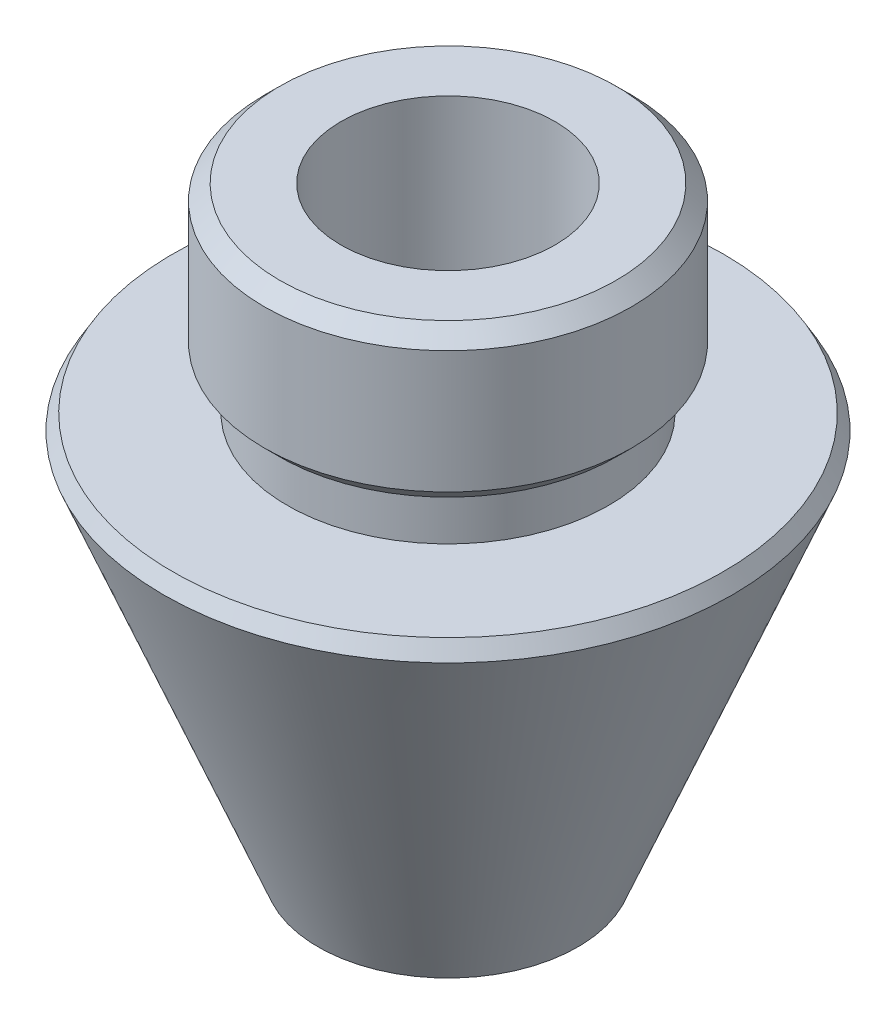
ISO-10303-21;
HEADER;
FILE_DESCRIPTION(('STEP AP214'),'2;1');
FILE_NAME('part.step','',(''),(''),'','','');
FILE_SCHEMA(('AUTOMOTIVE_DESIGN { 1 0 10303 214 1 1 1 1 }'));
ENDSEC;
DATA;
#1=APPLICATION_CONTEXT('core data for automotive mechanical design processes');
#2=APPLICATION_PROTOCOL_DEFINITION('international standard','automotive_design',2000,#1);
#3=PRODUCT_CONTEXT('',#1,'mechanical');
#4=PRODUCT('Part','Part','',(#3));
#5=PRODUCT_RELATED_PRODUCT_CATEGORY('part','',(#4));
#6=PRODUCT_DEFINITION_FORMATION('','',#4);
#7=PRODUCT_DEFINITION_CONTEXT('part definition',#1,'design');
#8=PRODUCT_DEFINITION('design','',#6,#7);
#9=PRODUCT_DEFINITION_SHAPE('','',#8);
#10=(LENGTH_UNIT() NAMED_UNIT(*) SI_UNIT(.MILLI.,.METRE.));
#11=(NAMED_UNIT(*) PLANE_ANGLE_UNIT() SI_UNIT($,.RADIAN.));
#12=(NAMED_UNIT(*) SI_UNIT($,.STERADIAN.) SOLID_ANGLE_UNIT());
#13=UNCERTAINTY_MEASURE_WITH_UNIT(LENGTH_MEASURE(1.E-05),#10,'distance_accuracy_value','');
#14=(GEOMETRIC_REPRESENTATION_CONTEXT(3) GLOBAL_UNCERTAINTY_ASSIGNED_CONTEXT((#13)) GLOBAL_UNIT_ASSIGNED_CONTEXT((#10,
#11,#12)) REPRESENTATION_CONTEXT('',''));
#15=CARTESIAN_POINT('',(0.,0.,0.));
#16=DIRECTION('',(0.,0.,1.));
#17=DIRECTION('',(1.,0.,0.));
#18=AXIS2_PLACEMENT_3D('',#15,#16,#17);
#19=CARTESIAN_POINT('',(0.,18.7681019127767,0.));
#20=DIRECTION('',(0.,-1.,0.));
#21=DIRECTION('',(0.,0.,-1.));
#22=AXIS2_PLACEMENT_3D('',#19,#20,#21);
#23=CONICAL_SURFACE('',#22,18.,0.5235987755983);
#24=CARTESIAN_POINT('',(0.,17.7491249910044,0.));
#25=DIRECTION('',(0.,-1.,0.));
#26=DIRECTION('',(0.,0.,-1.));
#27=AXIS2_PLACEMENT_3D('',#24,#25,#26);
#28=CIRCLE('',#27,18.5883066000832);
#29=CARTESIAN_POINT('',(0.,17.7491249910044,-18.5883066000832));
#30=VERTEX_POINT('',#29);
#31=EDGE_CURVE('E72',#30,#30,#28,.T.);
#32=ORIENTED_EDGE('',*,*,#31,.F.);
#33=EDGE_LOOP('',(#32));
#34=FACE_BOUND('',#33,.T.);
#35=CARTESIAN_POINT('',(0.,18.7681019127767,0.));
#36=DIRECTION('',(0.,-1.,0.));
#37=DIRECTION('',(0.,0.,-1.));
#38=AXIS2_PLACEMENT_3D('',#35,#36,#37);
#39=CIRCLE('',#38,18.);
#40=CARTESIAN_POINT('',(0.,18.7681019127767,-18.));
#41=VERTEX_POINT('',#40);
#42=EDGE_CURVE('E54',#41,#41,#39,.T.);
#43=ORIENTED_EDGE('',*,*,#42,.T.);
#44=EDGE_LOOP('',(#43));
#45=FACE_BOUND('',#44,.T.);
#46=ADVANCED_FACE('F34',(#34,#45),#23,.T.);
#47=CARTESIAN_POINT('',(0.,18.7681019127767,0.));
#48=DIRECTION('',(0.,-1.,0.));
#49=DIRECTION('',(0.,0.,-1.));
#50=AXIS2_PLACEMENT_3D('',#47,#48,#49);
#51=PLANE('',#50);
#52=ORIENTED_EDGE('',*,*,#42,.F.);
#53=EDGE_LOOP('',(#52));
#54=FACE_BOUND('',#53,.T.);
#55=CARTESIAN_POINT('',(0.,18.7681019127767,0.));
#56=DIRECTION('',(0.,-1.,0.));
#57=DIRECTION('',(0.,0.,-1.));
#58=AXIS2_PLACEMENT_3D('',#55,#56,#57);
#59=CIRCLE('',#58,10.5);
#60=CARTESIAN_POINT('',(0.,18.7681019127767,-10.5));
#61=VERTEX_POINT('',#60);
#62=EDGE_CURVE('E57',#61,#61,#59,.T.);
#63=ORIENTED_EDGE('',*,*,#62,.T.);
#64=EDGE_LOOP('',(#63));
#65=FACE_BOUND('',#64,.T.);
#66=ADVANCED_FACE('F80',(#54,#65),#51,.F.);
#67=CARTESIAN_POINT('',(0.,0.,0.));
#68=DIRECTION('',(0.,-1.,0.));
#69=DIRECTION('',(0.,0.,-1.));
#70=AXIS2_PLACEMENT_3D('',#67,#68,#69);
#71=CYLINDRICAL_SURFACE('',#70,10.5);
#72=CARTESIAN_POINT('',(0.,21.7681019127767,0.));
#73=DIRECTION('',(0.,-1.,0.));
#74=DIRECTION('',(0.,0.,-1.));
#75=AXIS2_PLACEMENT_3D('',#72,#73,#74);
#76=CIRCLE('',#75,10.5);
#77=CARTESIAN_POINT('',(0.,21.7681019127767,-10.5));
#78=VERTEX_POINT('',#77);
#79=EDGE_CURVE('E60',#78,#78,#76,.T.);
#80=ORIENTED_EDGE('',*,*,#79,.T.);
#81=EDGE_LOOP('',(#80));
#82=FACE_BOUND('',#81,.T.);
#83=ORIENTED_EDGE('',*,*,#62,.F.);
#84=EDGE_LOOP('',(#83));
#85=FACE_BOUND('',#84,.T.);
#86=ADVANCED_FACE('F86',(#82,#85),#71,.T.);
#87=CARTESIAN_POINT('',(0.,21.7681019127767,0.));
#88=DIRECTION('',(0.,-1.,0.));
#89=DIRECTION('',(0.,0.,-1.));
#90=AXIS2_PLACEMENT_3D('',#87,#88,#89);
#91=PLANE('',#90);
#92=CARTESIAN_POINT('',(0.,21.7681019127767,0.));
#93=DIRECTION('',(0.,-1.,0.));
#94=DIRECTION('',(0.,0.,-1.));
#95=AXIS2_PLACEMENT_3D('',#92,#93,#94);
#96=CIRCLE('',#95,11.);
#97=CARTESIAN_POINT('',(0.,21.7681019127767,-11.));
#98=VERTEX_POINT('',#97);
#99=EDGE_CURVE('E41',#98,#98,#96,.T.);
#100=ORIENTED_EDGE('',*,*,#99,.T.);
#101=EDGE_LOOP('',(#100));
#102=FACE_BOUND('',#101,.T.);
#103=ORIENTED_EDGE('',*,*,#79,.F.);
#104=EDGE_LOOP('',(#103));
#105=FACE_BOUND('',#104,.T.);
#106=ADVANCED_FACE('F91',(#102,#105),#91,.T.);
#107=CARTESIAN_POINT('',(0.,0.,0.));
#108=DIRECTION('',(0.,-1.,0.));
#109=DIRECTION('',(0.,0.,-1.));
#110=AXIS2_PLACEMENT_3D('',#107,#108,#109);
#111=CYLINDRICAL_SURFACE('',#110,12.);
#112=CARTESIAN_POINT('',(0.,22.7681019127766,0.));
#113=DIRECTION('',(0.,-1.,0.));
#114=DIRECTION('',(0.,0.,-1.));
#115=AXIS2_PLACEMENT_3D('',#112,#113,#114);
#116=CIRCLE('',#115,12.);
#117=CARTESIAN_POINT('',(0.,22.7681019127766,-12.));
#118=VERTEX_POINT('',#117);
#119=EDGE_CURVE('E10',#118,#118,#116,.F.);
#120=ORIENTED_EDGE('',*,*,#119,.T.);
#121=EDGE_LOOP('',(#120));
#122=FACE_BOUND('',#121,.T.);
#123=CARTESIAN_POINT('',(0.,30.7681019127767,0.));
#124=DIRECTION('',(0.,1.,0.));
#125=DIRECTION('',(0.,0.,1.));
#126=AXIS2_PLACEMENT_3D('',#123,#124,#125);
#127=CIRCLE('',#126,12.);
#128=CARTESIAN_POINT('',(0.,30.7681019127767,12.));
#129=VERTEX_POINT('',#128);
#130=EDGE_CURVE('E49',#129,#129,#127,.F.);
#131=ORIENTED_EDGE('',*,*,#130,.T.);
#132=EDGE_LOOP('',(#131));
#133=FACE_BOUND('',#132,.T.);
#134=ADVANCED_FACE('F97',(#122,#133),#111,.T.);
#135=CARTESIAN_POINT('',(0.,31.7681019127767,0.));
#136=DIRECTION('',(0.,1.,0.));
#137=DIRECTION('',(0.,0.,1.));
#138=AXIS2_PLACEMENT_3D('',#135,#136,#137);
#139=PLANE('',#138);
#140=CARTESIAN_POINT('',(0.,31.7681019127767,0.));
#141=DIRECTION('',(0.,1.,0.));
#142=DIRECTION('',(0.,0.,1.));
#143=AXIS2_PLACEMENT_3D('',#140,#141,#142);
#144=CIRCLE('',#143,11.);
#145=CARTESIAN_POINT('',(0.,31.7681019127767,11.));
#146=VERTEX_POINT('',#145);
#147=EDGE_CURVE('E45',#146,#146,#144,.T.);
#148=ORIENTED_EDGE('',*,*,#147,.T.);
#149=EDGE_LOOP('',(#148));
#150=FACE_BOUND('',#149,.T.);
#151=CARTESIAN_POINT('',(0.,31.7681019127767,0.));
#152=DIRECTION('',(0.,-1.,0.));
#153=DIRECTION('',(0.,0.,-1.));
#154=AXIS2_PLACEMENT_3D('',#151,#152,#153);
#155=CIRCLE('',#154,7.);
#156=CARTESIAN_POINT('',(0.,31.7681019127767,-7.));
#157=VERTEX_POINT('',#156);
#158=EDGE_CURVE('E63',#157,#157,#155,.T.);
#159=ORIENTED_EDGE('',*,*,#158,.T.);
#160=EDGE_LOOP('',(#159));
#161=FACE_BOUND('',#160,.T.);
#162=ADVANCED_FACE('F116',(#150,#161),#139,.T.);
#163=CARTESIAN_POINT('',(0.,0.,0.));
#164=DIRECTION('',(0.,-1.,0.));
#165=DIRECTION('',(0.,0.,-1.));
#166=AXIS2_PLACEMENT_3D('',#163,#164,#165);
#167=CYLINDRICAL_SURFACE('',#166,7.);
#168=CARTESIAN_POINT('',(0.,-7.23189808722334,0.));
#169=DIRECTION('',(0.,-1.,0.));
#170=DIRECTION('',(0.,0.,-1.));
#171=AXIS2_PLACEMENT_3D('',#168,#169,#170);
#172=CIRCLE('',#171,7.);
#173=CARTESIAN_POINT('',(0.,-7.23189808722334,-7.));
#174=VERTEX_POINT('',#173);
#175=EDGE_CURVE('E66',#174,#174,#172,.T.);
#176=ORIENTED_EDGE('',*,*,#175,.T.);
#177=EDGE_LOOP('',(#176));
#178=FACE_BOUND('',#177,.T.);
#179=ORIENTED_EDGE('',*,*,#158,.F.);
#180=EDGE_LOOP('',(#179));
#181=FACE_BOUND('',#180,.T.);
#182=ADVANCED_FACE('F120',(#178,#181),#167,.F.);
#183=CARTESIAN_POINT('',(0.,-7.23189808722334,0.));
#184=DIRECTION('',(0.,1.,0.));
#185=DIRECTION('',(0.,0.,1.));
#186=AXIS2_PLACEMENT_3D('',#183,#184,#185);
#187=PLANE('',#186);
#188=ORIENTED_EDGE('',*,*,#175,.F.);
#189=EDGE_LOOP('',(#188));
#190=FACE_BOUND('',#189,.T.);
#191=CARTESIAN_POINT('',(0.,-7.23189808722334,0.));
#192=DIRECTION('',(0.,-1.,0.));
#193=DIRECTION('',(0.,0.,-1.));
#194=AXIS2_PLACEMENT_3D('',#191,#192,#193);
#195=CIRCLE('',#194,8.49531812828601);
#196=CARTESIAN_POINT('',(0.,-7.23189808722334,-8.49531812828601));
#197=VERTEX_POINT('',#196);
#198=EDGE_CURVE('E69',#197,#197,#195,.T.);
#199=ORIENTED_EDGE('',*,*,#198,.T.);
#200=EDGE_LOOP('',(#199));
#201=FACE_BOUND('',#200,.T.);
#202=ADVANCED_FACE('F108',(#190,#201),#187,.F.);
#203=CARTESIAN_POINT('',(0.,17.7491249910044,0.));
#204=DIRECTION('',(0.,1.,0.));
#205=DIRECTION('',(0.,0.,1.));
#206=AXIS2_PLACEMENT_3D('',#203,#204,#205);
#207=CONICAL_SURFACE('',#206,18.5883066000832,0.38397243543875);
#208=ORIENTED_EDGE('',*,*,#198,.F.);
#209=EDGE_LOOP('',(#208));
#210=FACE_BOUND('',#209,.T.);
#211=ORIENTED_EDGE('',*,*,#31,.T.);
#212=EDGE_LOOP('',(#211));
#213=FACE_BOUND('',#212,.T.);
#214=ADVANCED_FACE('F76',(#210,#213),#207,.T.);
#215=CARTESIAN_POINT('',(0.,30.7681019127767,0.));
#216=DIRECTION('',(0.,-1.,0.));
#217=DIRECTION('',(0.,0.,-1.));
#218=AXIS2_PLACEMENT_3D('',#215,#216,#217);
#219=CONICAL_SURFACE('',#218,12.,0.785398163397453);
#220=ORIENTED_EDGE('',*,*,#147,.F.);
#221=EDGE_LOOP('',(#220));
#222=FACE_BOUND('',#221,.T.);
#223=ORIENTED_EDGE('',*,*,#130,.F.);
#224=EDGE_LOOP('',(#223));
#225=FACE_BOUND('',#224,.T.);
#226=ADVANCED_FACE('F100',(#222,#225),#219,.T.);
#227=CARTESIAN_POINT('',(0.,21.7681019127767,0.));
#228=DIRECTION('',(0.,1.,0.));
#229=DIRECTION('',(0.,0.,1.));
#230=AXIS2_PLACEMENT_3D('',#227,#228,#229);
#231=CONICAL_SURFACE('',#230,11.,0.785398163397447);
#232=ORIENTED_EDGE('',*,*,#119,.F.);
#233=EDGE_LOOP('',(#232));
#234=FACE_BOUND('',#233,.T.);
#235=ORIENTED_EDGE('',*,*,#99,.F.);
#236=EDGE_LOOP('',(#235));
#237=FACE_BOUND('',#236,.T.);
#238=ADVANCED_FACE('F36',(#234,#237),#231,.T.);
#239=CLOSED_SHELL('',(#46,#66,#86,#106,#134,#162,#182,#202,#214,#226,#238));
#240=MANIFOLD_SOLID_BREP('B2',#239);
#241=ADVANCED_BREP_SHAPE_REPRESENTATION('',(#18,#240),#14);
#242=SHAPE_DEFINITION_REPRESENTATION(#9,#241);
ENDSEC;
END-ISO-10303-21;
